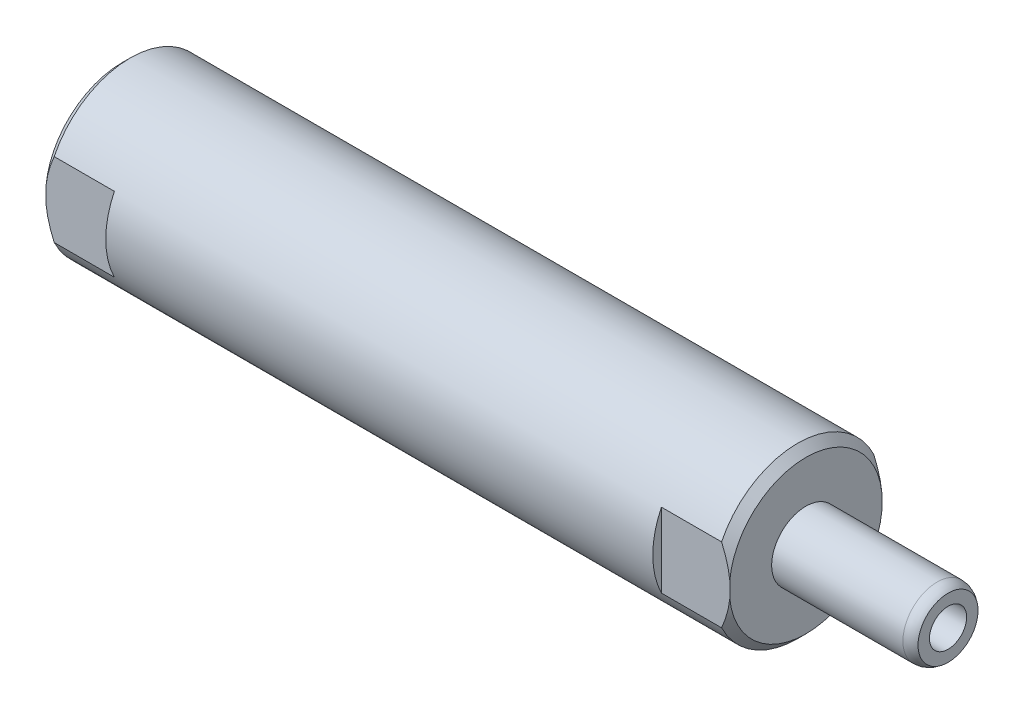
ISO-10303-21;
HEADER;
FILE_DESCRIPTION(('STEP AP214'),'2;1');
FILE_NAME('part.step','',(''),(''),'','','');
FILE_SCHEMA(('AUTOMOTIVE_DESIGN { 1 0 10303 214 1 1 1 1 }'));
ENDSEC;
DATA;
#1=APPLICATION_CONTEXT('core data for automotive mechanical design processes');
#2=APPLICATION_PROTOCOL_DEFINITION('international standard','automotive_design',2000,#1);
#3=PRODUCT_CONTEXT('',#1,'mechanical');
#4=PRODUCT('Part','Part','',(#3));
#5=PRODUCT_RELATED_PRODUCT_CATEGORY('part','',(#4));
#6=PRODUCT_DEFINITION_FORMATION('','',#4);
#7=PRODUCT_DEFINITION_CONTEXT('part definition',#1,'design');
#8=PRODUCT_DEFINITION('design','',#6,#7);
#9=PRODUCT_DEFINITION_SHAPE('','',#8);
#10=(LENGTH_UNIT() NAMED_UNIT(*) SI_UNIT(.MILLI.,.METRE.));
#11=(NAMED_UNIT(*) PLANE_ANGLE_UNIT() SI_UNIT($,.RADIAN.));
#12=(NAMED_UNIT(*) SI_UNIT($,.STERADIAN.) SOLID_ANGLE_UNIT());
#13=UNCERTAINTY_MEASURE_WITH_UNIT(LENGTH_MEASURE(1.E-05),#10,'distance_accuracy_value','');
#14=(GEOMETRIC_REPRESENTATION_CONTEXT(3) GLOBAL_UNCERTAINTY_ASSIGNED_CONTEXT((#13)) GLOBAL_UNIT_ASSIGNED_CONTEXT((#10,
#11,#12)) REPRESENTATION_CONTEXT('',''));
#15=CARTESIAN_POINT('',(0.,0.,0.));
#16=DIRECTION('',(0.,0.,1.));
#17=DIRECTION('',(1.,0.,0.));
#18=AXIS2_PLACEMENT_3D('',#15,#16,#17);
#19=CARTESIAN_POINT('',(62.738,0.,0.));
#20=DIRECTION('',(-1.,0.,0.));
#21=DIRECTION('',(0.,0.,1.));
#22=AXIS2_PLACEMENT_3D('',#19,#20,#21);
#23=CONICAL_SURFACE('',#22,7.8613,0.785398163397451);
#24=CARTESIAN_POINT('',(53.293167338345,-15.800053236075,7.0612));
#25=CARTESIAN_POINT('',(53.5049275174837,-15.5681034147408,7.0612));
#26=CARTESIAN_POINT('',(53.7162690974534,-15.3357714901483,7.0612));
#27=CARTESIAN_POINT('',(54.1379917729007,-14.8702340424233,7.0612));
#28=CARTESIAN_POINT('',(54.3483728600565,-14.6370285117535,7.0612));
#29=CARTESIAN_POINT('',(54.977987894128,-13.935828814462,7.0612));
#30=CARTESIAN_POINT('',(55.3955896179336,-13.4663652133773,7.0612));
#31=CARTESIAN_POINT('',(56.2280256203956,-12.5189680607733,7.0612));
#32=CARTESIAN_POINT('',(56.6428182680432,-12.0409978515424,7.0612));
#33=CARTESIAN_POINT('',(57.4643808191008,-11.0782975911991,7.0612));
#34=CARTESIAN_POINT('',(57.8711517796829,-10.5935684454107,7.0612));
#35=CARTESIAN_POINT('',(58.6122949547526,-9.68939025934885,7.0612));
#36=CARTESIAN_POINT('',(58.948254138589,-9.27124919082648,7.0612));
#37=CARTESIAN_POINT('',(59.4437409714594,-8.63731468734378,7.0612));
#38=CARTESIAN_POINT('',(59.6075217567377,-8.42484595578594,7.0612));
#39=CARTESIAN_POINT('',(59.9316717676401,-7.99732525007659,7.0612));
#40=CARTESIAN_POINT('',(60.0920410862308,-7.78227334657022,7.0612));
#41=CARTESIAN_POINT('',(60.4084499478485,-7.34946591407669,7.0612));
#42=CARTESIAN_POINT('',(60.5644952768056,-7.13171462455565,7.0612));
#43=CARTESIAN_POINT('',(60.8716005394315,-6.69269819678305,7.0612));
#44=CARTESIAN_POINT('',(61.0226602333263,-6.47143289028783,7.0612));
#45=CARTESIAN_POINT('',(61.3185493535055,-6.02492623678023,7.0612));
#46=CARTESIAN_POINT('',(61.4633819995288,-5.79968703158059,7.0612));
#47=CARTESIAN_POINT('',(61.7453735082657,-5.34447391015752,7.0612));
#48=CARTESIAN_POINT('',(61.8825334425164,-5.11450066123727,7.0612));
#49=CARTESIAN_POINT('',(62.1438928545597,-4.65491032616366,7.0612));
#50=CARTESIAN_POINT('',(62.268331805639,-4.42543025459788,7.0612));
#51=CARTESIAN_POINT('',(62.5057045880346,-3.9605167938688,7.0612));
#52=CARTESIAN_POINT('',(62.6186373363574,-3.72508284690978,7.0612));
#53=CARTESIAN_POINT('',(62.8298144638868,-3.24807903864895,7.0612));
#54=CARTESIAN_POINT('',(62.9280808415205,-3.006519015901,7.0612));
#55=CARTESIAN_POINT('',(63.1064608050052,-2.51674849823724,7.0612));
#56=CARTESIAN_POINT('',(63.1865794737875,-2.26853988733677,7.0612));
#57=CARTESIAN_POINT('',(63.311369118663,-1.8142446765933,7.0612));
#58=CARTESIAN_POINT('',(63.3598927316566,-1.60922259694954,7.0612));
#59=CARTESIAN_POINT('',(63.4404053553681,-1.19593626302968,7.0612));
#60=CARTESIAN_POINT('',(63.4723967189886,-0.987672474468585,7.0612));
#61=CARTESIAN_POINT('',(63.5182035163834,-0.569593034806168,7.0612));
#62=CARTESIAN_POINT('',(63.5320589941892,-0.359781834817912,7.0612));
#63=CARTESIAN_POINT('',(63.5409647991822,0.0602465124774527,7.0612));
#64=CARTESIAN_POINT('',(63.5360151148707,0.270463660032706,7.0612));
#65=CARTESIAN_POINT('',(63.5076113556258,0.689272720508541,7.0612));
#66=CARTESIAN_POINT('',(63.4841880322869,0.897866753078743,7.0612));
#67=CARTESIAN_POINT('',(63.4201012842225,1.31236766024443,7.0612));
#68=CARTESIAN_POINT('',(63.3794363985247,1.51827430559842,7.0612));
#69=CARTESIAN_POINT('',(63.2825937366098,1.92696620193596,7.0612));
#70=CARTESIAN_POINT('',(63.226373100563,2.12974117064129,7.0612));
#71=CARTESIAN_POINT('',(63.1006029094311,2.53105472161495,7.0612));
#72=CARTESIAN_POINT('',(63.0310538611671,2.72959346464942,7.0612));
#73=CARTESIAN_POINT('',(62.8568575689925,3.1846553815723,7.0612));
#74=CARTESIAN_POINT('',(62.748075737966,3.43958886594641,7.0612));
#75=CARTESIAN_POINT('',(62.5151562227275,3.94240089487963,7.0612));
#76=CARTESIAN_POINT('',(62.3910103483211,4.19027558921705,7.0612));
#77=CARTESIAN_POINT('',(62.130484648302,4.68010488045319,7.0612));
#78=CARTESIAN_POINT('',(61.994080567097,4.92204647807433,7.0612));
#79=CARTESIAN_POINT('',(61.7118702172748,5.4002882786855,7.0612));
#80=CARTESIAN_POINT('',(61.5660655658289,5.63658944246117,7.0612));
#81=CARTESIAN_POINT('',(61.2653547529032,6.10696672020908,7.0612));
#82=CARTESIAN_POINT('',(61.1103662717776,6.34098996063633,7.0612));
#83=CARTESIAN_POINT('',(60.7942954175425,6.80487911587369,7.0612));
#84=CARTESIAN_POINT('',(60.6332128502206,7.03474489784419,7.0612));
#85=CARTESIAN_POINT('',(60.3063183777181,7.49067027023617,7.0612));
#86=CARTESIAN_POINT('',(60.1405122451545,7.71673401125803,7.0612));
#87=CARTESIAN_POINT('',(59.8048776813793,8.16585887109829,7.0612));
#88=CARTESIAN_POINT('',(59.6350491262695,8.38891989709462,7.0612));
#89=CARTESIAN_POINT('',(59.2177997422505,8.92853278459556,7.0612));
#90=CARTESIAN_POINT('',(58.9686311656389,9.2437321778797,7.0612));
#91=CARTESIAN_POINT('',(58.4650216942898,9.86988942586683,7.0612));
#92=CARTESIAN_POINT('',(58.2105806536195,10.180847162772,7.0612));
#93=CARTESIAN_POINT('',(57.6974048040443,10.7994531726696,7.0612));
#94=CARTESIAN_POINT('',(57.4386679340847,11.1070997330893,7.0612));
#95=CARTESIAN_POINT('',(56.9178424994869,11.7195423881902,7.0612));
#96=CARTESIAN_POINT('',(56.6557539071958,12.0243384593179,7.0612));
#97=CARTESIAN_POINT('',(56.1379939716804,12.6210154756105,7.0612));
#98=CARTESIAN_POINT('',(55.882415812146,12.9129773749483,7.0612));
#99=CARTESIAN_POINT('',(55.3691420373119,13.4950356477495,7.0612));
#100=CARTESIAN_POINT('',(55.1114464091499,13.785132009862,7.0612));
#101=CARTESIAN_POINT('',(54.5945105099742,14.3634805033619,7.0612));
#102=CARTESIAN_POINT('',(54.3352718141855,14.6517340439233,7.0612));
#103=CARTESIAN_POINT('',(53.8152869190554,15.2268678279739,7.0612));
#104=CARTESIAN_POINT('',(53.5545407508161,15.5137480995745,7.0612));
#105=CARTESIAN_POINT('',(53.293167338345,15.800053236075,7.0612));
#106=B_SPLINE_CURVE_WITH_KNOTS('',3,(#24,#25,#26,#27,#28,#29,#30,#31,#32,#33,#34,#35,#36,#37,
#38,#39,#40,#41,#42,#43,#44,#45,#46,#47,#48,#49,#50,#51,#52,#53,#54,#55,#56,#57,#58,#59,#60,#61,
#62,#63,#64,#65,#66,#67,#68,#69,#70,#71,#72,#73,#74,#75,#76,#77,#78,#79,#80,#81,#82,#83,#84,#85,
#86,#87,#88,#89,#90,#91,#92,#93,#94,#95,#96,#97,#98,#99,#100,#101,#102,#103,#104,#105),
.UNSPECIFIED.,.F.,.F.,(4,2,2,2,2,2,2,2,2,2,2,2,2,2,2,2,2,2,2,2,2,2,2,2,2,2,2,2,2,2,2,2,2,2,2,2,
2,2,2,2,4),(0.,0.942223968323323,1.88445608470227,3.76938249821371,5.66789259895274,
7.56615080149852,9.17514997537867,9.97992364540112,10.784675356187,11.5882924133758,
12.3919480627301,13.1951830523521,13.998305584228,14.7811931690603,15.5641543733487,
16.345929131953,17.1274846543602,17.7589523680555,18.3903301852482,19.0203115555243,
19.6502933110106,20.2792285938059,20.9082171803937,21.5389563413221,22.1696715227654,
23.0005071569953,23.8317876126227,24.6647507675351,25.4975710089458,26.339530441258,
27.1815167286011,28.0225147946962,28.8635387988983,30.0688317280415,31.2741580622927,
32.4800804318634,33.6860127571736,34.8500701545965,36.0141346280983,37.1771651926882,
38.3401718468441),.UNSPECIFIED.);
#107=CARTESIAN_POINT('',(62.738,-3.45535703654484,7.0612));
#108=VERTEX_POINT('',#107);
#109=CARTESIAN_POINT('',(63.5,-0.734516882038761,7.0612));
#110=VERTEX_POINT('',#109);
#111=EDGE_CURVE('E42',#108,#110,#106,.T.);
#112=ORIENTED_EDGE('',*,*,#111,.F.);
#113=CARTESIAN_POINT('',(62.738,0.,0.));
#114=DIRECTION('',(1.,0.,0.));
#115=DIRECTION('',(0.,0.,-1.));
#116=AXIS2_PLACEMENT_3D('',#113,#114,#115);
#117=CIRCLE('',#116,7.8613);
#118=CARTESIAN_POINT('',(62.738,-3.45535703654484,-7.0612));
#119=VERTEX_POINT('',#118);
#120=EDGE_CURVE('E142',#119,#108,#117,.F.);
#121=ORIENTED_EDGE('',*,*,#120,.F.);
#122=CARTESIAN_POINT('',(53.293167338345,15.8000532360749,-7.0612));
#123=CARTESIAN_POINT('',(53.5049275174837,15.5681034147408,-7.0612));
#124=CARTESIAN_POINT('',(53.7162690974534,15.3357714901483,-7.0612));
#125=CARTESIAN_POINT('',(54.1379917729007,14.8702340424233,-7.0612));
#126=CARTESIAN_POINT('',(54.3483728600565,14.6370285117535,-7.0612));
#127=CARTESIAN_POINT('',(54.977987894128,13.935828814462,-7.0612));
#128=CARTESIAN_POINT('',(55.3955896179336,13.4663652133773,-7.0612));
#129=CARTESIAN_POINT('',(56.2280256203956,12.5189680607733,-7.0612));
#130=CARTESIAN_POINT('',(56.6428182680432,12.0409978515424,-7.0612));
#131=CARTESIAN_POINT('',(57.4643808191009,11.0782975911991,-7.0612));
#132=CARTESIAN_POINT('',(57.8711517796829,10.5935684454107,-7.0612));
#133=CARTESIAN_POINT('',(58.6122949547526,9.68939025934884,-7.0612));
#134=CARTESIAN_POINT('',(58.948254138589,9.27124919082647,-7.0612));
#135=CARTESIAN_POINT('',(59.4437409714594,8.63731468734376,-7.0612));
#136=CARTESIAN_POINT('',(59.6075217567377,8.42484595578592,-7.0612));
#137=CARTESIAN_POINT('',(59.9316717676401,7.99732525007657,-7.0612));
#138=CARTESIAN_POINT('',(60.0920410862309,7.78227334657019,-7.0612));
#139=CARTESIAN_POINT('',(60.4084499478485,7.34946591407666,-7.0612));
#140=CARTESIAN_POINT('',(60.5644952768057,7.13171462455562,-7.0612));
#141=CARTESIAN_POINT('',(60.8716005394315,6.69269819678301,-7.0612));
#142=CARTESIAN_POINT('',(61.0226602333263,6.47143289028779,-7.0612));
#143=CARTESIAN_POINT('',(61.3185493535056,6.02492623678018,-7.0612));
#144=CARTESIAN_POINT('',(61.4633819995288,5.79968703158054,-7.0612));
#145=CARTESIAN_POINT('',(61.7453735082658,5.34447391015746,-7.0612));
#146=CARTESIAN_POINT('',(61.8825334425165,5.11450066123722,-7.0612));
#147=CARTESIAN_POINT('',(62.1438928545597,4.6549103261636,-7.0612));
#148=CARTESIAN_POINT('',(62.2683318056391,4.42543025459783,-7.0612));
#149=CARTESIAN_POINT('',(62.5057045880346,3.96051679386875,-7.0612));
#150=CARTESIAN_POINT('',(62.6186373363574,3.72508284690973,-7.0612));
#151=CARTESIAN_POINT('',(62.8298144638868,3.2480790386489,-7.0612));
#152=CARTESIAN_POINT('',(62.9280808415205,3.00651901590095,-7.0612));
#153=CARTESIAN_POINT('',(63.1064608050052,2.51674849823718,-7.0612));
#154=CARTESIAN_POINT('',(63.1865794737875,2.26853988733672,-7.0612));
#155=CARTESIAN_POINT('',(63.311369118663,1.81424467659325,-7.0612));
#156=CARTESIAN_POINT('',(63.3598927316566,1.60922259694949,-7.0612));
#157=CARTESIAN_POINT('',(63.4404053553682,1.19593626302963,-7.0612));
#158=CARTESIAN_POINT('',(63.4723967189886,0.987672474468532,-7.0612));
#159=CARTESIAN_POINT('',(63.5182035163834,0.569593034806117,-7.0612));
#160=CARTESIAN_POINT('',(63.5320589941892,0.359781834817861,-7.0612));
#161=CARTESIAN_POINT('',(63.5409647991822,-0.0602465124775034,-7.0612));
#162=CARTESIAN_POINT('',(63.5360151148707,-0.270463660032755,-7.0612));
#163=CARTESIAN_POINT('',(63.5076113556258,-0.689272720508589,-7.0612));
#164=CARTESIAN_POINT('',(63.4841880322869,-0.897866753078792,-7.0612));
#165=CARTESIAN_POINT('',(63.4201012842224,-1.31236766024448,-7.0612));
#166=CARTESIAN_POINT('',(63.3794363985247,-1.51827430559847,-7.0612));
#167=CARTESIAN_POINT('',(63.2825937366098,-1.92696620193601,-7.0612));
#168=CARTESIAN_POINT('',(63.226373100563,-2.12974117064134,-7.0612));
#169=CARTESIAN_POINT('',(63.1006029094311,-2.53105472161499,-7.0612));
#170=CARTESIAN_POINT('',(63.031053861167,-2.72959346464946,-7.0612));
#171=CARTESIAN_POINT('',(62.8568575689925,-3.18465538157235,-7.0612));
#172=CARTESIAN_POINT('',(62.748075737966,-3.43958886594646,-7.0612));
#173=CARTESIAN_POINT('',(62.5151562227275,-3.94240089487968,-7.0612));
#174=CARTESIAN_POINT('',(62.3910103483211,-4.19027558921711,-7.0612));
#175=CARTESIAN_POINT('',(62.130484648302,-4.68010488045326,-7.0612));
#176=CARTESIAN_POINT('',(61.994080567097,-4.92204647807441,-7.0612));
#177=CARTESIAN_POINT('',(61.7118702172748,-5.40028827868558,-7.0612));
#178=CARTESIAN_POINT('',(61.5660655658289,-5.63658944246126,-7.0612));
#179=CARTESIAN_POINT('',(61.2653547529031,-6.10696672020917,-7.0612));
#180=CARTESIAN_POINT('',(61.1103662717776,-6.34098996063642,-7.0612));
#181=CARTESIAN_POINT('',(60.7942954175424,-6.80487911587379,-7.0612));
#182=CARTESIAN_POINT('',(60.6332128502205,-7.03474489784429,-7.0612));
#183=CARTESIAN_POINT('',(60.306318377718,-7.49067027023629,-7.0612));
#184=CARTESIAN_POINT('',(60.1405122451544,-7.71673401125815,-7.0612));
#185=CARTESIAN_POINT('',(59.8048776813792,-8.16585887109841,-7.0612));
#186=CARTESIAN_POINT('',(59.6350491262694,-8.38891989709475,-7.0612));
#187=CARTESIAN_POINT('',(59.2177997422503,-8.92853278459569,-7.0612));
#188=CARTESIAN_POINT('',(58.9686311656388,-9.24373217787982,-7.0612));
#189=CARTESIAN_POINT('',(58.4650216942897,-9.86988942586693,-7.0612));
#190=CARTESIAN_POINT('',(58.2105806536194,-10.1808471627721,-7.0612));
#191=CARTESIAN_POINT('',(57.6974048040443,-10.7994531726697,-7.0612));
#192=CARTESIAN_POINT('',(57.4386679340846,-11.1070997330893,-7.0612));
#193=CARTESIAN_POINT('',(56.9178424994869,-11.7195423881902,-7.0612));
#194=CARTESIAN_POINT('',(56.6557539071957,-12.0243384593179,-7.0612));
#195=CARTESIAN_POINT('',(56.1379939716803,-12.6210154756105,-7.0612));
#196=CARTESIAN_POINT('',(55.882415812146,-12.9129773749484,-7.0612));
#197=CARTESIAN_POINT('',(55.3691420373118,-13.4950356477496,-7.0612));
#198=CARTESIAN_POINT('',(55.1114464091499,-13.785132009862,-7.0612));
#199=CARTESIAN_POINT('',(54.5945105099742,-14.3634805033619,-7.0612));
#200=CARTESIAN_POINT('',(54.3352718141854,-14.6517340439233,-7.0612));
#201=CARTESIAN_POINT('',(53.8152869190554,-15.2268678279739,-7.0612));
#202=CARTESIAN_POINT('',(53.5545407508161,-15.5137480995745,-7.0612));
#203=CARTESIAN_POINT('',(53.293167338345,-15.8000532360749,-7.0612));
#204=B_SPLINE_CURVE_WITH_KNOTS('',3,(#122,#123,#124,#125,#126,#127,#128,#129,#130,#131,#132,
#133,#134,#135,#136,#137,#138,#139,#140,#141,#142,#143,#144,#145,#146,#147,#148,#149,#150,#151,
#152,#153,#154,#155,#156,#157,#158,#159,#160,#161,#162,#163,#164,#165,#166,#167,#168,#169,#170,
#171,#172,#173,#174,#175,#176,#177,#178,#179,#180,#181,#182,#183,#184,#185,#186,#187,#188,#189,
#190,#191,#192,#193,#194,#195,#196,#197,#198,#199,#200,#201,#202,#203),.UNSPECIFIED.,.F.,.F.,(4,
2,2,2,2,2,2,2,2,2,2,2,2,2,2,2,2,2,2,2,2,2,2,2,2,2,2,2,2,2,2,2,2,2,2,2,2,2,2,2,4),(0.,
0.942223968323325,1.88445608470226,3.76938249821372,5.66789259895274,7.56615080149853,
9.17514997537869,9.97992364540114,10.7846753561871,11.5882924133758,12.3919480627302,
13.1951830523521,13.9983055842281,14.7811931690603,15.5641543733487,16.3459291319531,
17.1274846543603,17.7589523680556,18.3903301852483,19.0203115555244,19.6502933110106,
20.279228593806,20.9082171803937,21.5389563413221,22.1696715227655,23.0005071569953,
23.8317876126228,24.6647507675352,25.4975710089459,26.3395304412581,27.1815167286012,
28.0225147946964,28.8635387988985,30.0688317280417,31.2741580622928,32.4800804318635,
33.6860127571737,34.8500701545966,36.0141346280983,37.1771651926882,38.3401718468441),.UNSPECIFIED.);
#205=CARTESIAN_POINT('',(63.5,-0.734516882038759,-7.0612));
#206=VERTEX_POINT('',#205);
#207=EDGE_CURVE('E312',#206,#119,#204,.T.);
#208=ORIENTED_EDGE('',*,*,#207,.F.);
#209=CARTESIAN_POINT('',(63.5,0.,0.));
#210=DIRECTION('',(1.,0.,0.));
#211=DIRECTION('',(0.,0.,-1.));
#212=AXIS2_PLACEMENT_3D('',#209,#210,#211);
#213=CIRCLE('',#212,7.0993);
#214=EDGE_CURVE('E56',#110,#206,#213,.T.);
#215=ORIENTED_EDGE('',*,*,#214,.F.);
#216=EDGE_LOOP('',(#112,#121,#208,#215));
#217=FACE_BOUND('',#216,.T.);
#218=ADVANCED_FACE('F33',(#217),#23,.T.);
#219=CARTESIAN_POINT('',(0.,0.,0.));
#220=DIRECTION('',(1.,0.,0.));
#221=DIRECTION('',(0.,0.,-1.));
#222=AXIS2_PLACEMENT_3D('',#219,#220,#221);
#223=CONICAL_SURFACE('',#222,7.0993,0.785398163397437);
#224=CARTESIAN_POINT('',(10.206832661655,15.8000532360747,7.0612));
#225=CARTESIAN_POINT('',(9.99507248251633,15.5681034147405,7.0612));
#226=CARTESIAN_POINT('',(9.78373090254667,15.3357714901481,7.0612));
#227=CARTESIAN_POINT('',(9.36200822709937,14.870234042423,7.0612));
#228=CARTESIAN_POINT('',(9.15162713994351,14.6370285117533,7.0612));
#229=CARTESIAN_POINT('',(8.52201210587203,13.9358288144618,7.0612));
#230=CARTESIAN_POINT('',(8.10441038206648,13.4663652133772,7.0612));
#231=CARTESIAN_POINT('',(7.27197437960443,12.5189680607732,7.0612));
#232=CARTESIAN_POINT('',(6.85718173195692,12.0409978515423,7.0612));
#233=CARTESIAN_POINT('',(6.03561918089923,11.078297591199,7.0612));
#234=CARTESIAN_POINT('',(5.62884822031721,10.5935684454106,7.0612));
#235=CARTESIAN_POINT('',(4.88770504524749,9.68939025934882,7.0612));
#236=CARTESIAN_POINT('',(4.55174586141112,9.27124919082648,7.0612));
#237=CARTESIAN_POINT('',(4.05625902854075,8.63731468734381,7.0612));
#238=CARTESIAN_POINT('',(3.8924782432624,8.42484595578598,7.0612));
#239=CARTESIAN_POINT('',(3.56832823236001,7.99732525007667,7.0612));
#240=CARTESIAN_POINT('',(3.40795891376932,7.78227334657031,7.0612));
#241=CARTESIAN_POINT('',(3.09155005215165,7.3494659140768,7.0612));
#242=CARTESIAN_POINT('',(2.93550472319452,7.13171462455578,7.0612));
#243=CARTESIAN_POINT('',(2.62839946056867,6.6926981967832,7.0612));
#244=CARTESIAN_POINT('',(2.47733976667385,6.471432890288,7.0612));
#245=CARTESIAN_POINT('',(2.18145064649465,6.02492623678043,7.0612));
#246=CARTESIAN_POINT('',(2.03661800047142,5.7996870315808,7.0612));
#247=CARTESIAN_POINT('',(1.75462649173447,5.34447391015776,7.0612));
#248=CARTESIAN_POINT('',(1.61746655748374,5.11450066123754,7.0612));
#249=CARTESIAN_POINT('',(1.35610714544049,4.65491032616393,7.0612));
#250=CARTESIAN_POINT('',(1.23166819436114,4.42543025459815,7.0612));
#251=CARTESIAN_POINT('',(0.994295411965531,3.96051679386908,7.0612));
#252=CARTESIAN_POINT('',(0.881362663642727,3.72508284691006,7.0612));
#253=CARTESIAN_POINT('',(0.670185536113354,3.24807903864922,7.0612));
#254=CARTESIAN_POINT('',(0.571919158479581,3.00651901590127,7.0612));
#255=CARTESIAN_POINT('',(0.39353919499491,2.5167484982375,7.0612));
#256=CARTESIAN_POINT('',(0.313420526212575,2.26853988733704,7.0612));
#257=CARTESIAN_POINT('',(0.18863088133711,1.81424467659357,7.0612));
#258=CARTESIAN_POINT('',(0.140107268343498,1.60922259694981,7.0612));
#259=CARTESIAN_POINT('',(0.0595946446318899,1.19593626302996,7.0612));
#260=CARTESIAN_POINT('',(0.0276032810114563,0.98767247446887,7.0612));
#261=CARTESIAN_POINT('',(-0.0182035163833669,0.569593034806462,7.0612));
#262=CARTESIAN_POINT('',(-0.0320589941891739,0.35978183481821,7.0612));
#263=CARTESIAN_POINT('',(-0.0409647991821803,-0.0602465124771493,7.0612));
#264=CARTESIAN_POINT('',(-0.0360151148707246,-0.270463660032399,7.0612));
#265=CARTESIAN_POINT('',(-0.00761135562582039,-0.689272720508228,7.0612));
#266=CARTESIAN_POINT('',(0.0158119677130364,-0.897866753078429,7.0612));
#267=CARTESIAN_POINT('',(0.079898715777477,-1.31236766024411,7.0612));
#268=CARTESIAN_POINT('',(0.120563601475266,-1.5182743055981,7.0612));
#269=CARTESIAN_POINT('',(0.217406263390111,-1.92696620193564,7.0612));
#270=CARTESIAN_POINT('',(0.273626899436888,-2.12974117064097,7.0612));
#271=CARTESIAN_POINT('',(0.399397090568765,-2.53105472161463,7.0612));
#272=CARTESIAN_POINT('',(0.468946138832838,-2.7295934646491,7.0612));
#273=CARTESIAN_POINT('',(0.643142431007394,-3.18465538157195,7.0612));
#274=CARTESIAN_POINT('',(0.751924262033857,-3.43958886594601,7.0612));
#275=CARTESIAN_POINT('',(0.984843777272306,-3.94240089487915,7.0612));
#276=CARTESIAN_POINT('',(1.10898965167868,-4.19027558921654,7.0612));
#277=CARTESIAN_POINT('',(1.3695153516977,-4.68010488045261,7.0612));
#278=CARTESIAN_POINT('',(1.50591943290268,-4.92204647807372,7.0612));
#279=CARTESIAN_POINT('',(1.78812978272483,-5.40028827868481,7.0612));
#280=CARTESIAN_POINT('',(1.93393443417064,-5.63658944246045,7.0612));
#281=CARTESIAN_POINT('',(2.23464524709636,-6.10696672020829,7.0612));
#282=CARTESIAN_POINT('',(2.38963372822189,-6.3409899606355,7.0612));
#283=CARTESIAN_POINT('',(2.70570458245695,-6.80487911587279,7.0612));
#284=CARTESIAN_POINT('',(2.86678714977881,-7.03474489784326,7.0612));
#285=CARTESIAN_POINT('',(3.19368162228128,-7.49067027023518,7.0612));
#286=CARTESIAN_POINT('',(3.35948775484481,-7.716734011257,7.0612));
#287=CARTESIAN_POINT('',(3.69512231861993,-8.1658588710972,7.0612));
#288=CARTESIAN_POINT('',(3.86495087372976,-8.38891989709349,7.0612));
#289=CARTESIAN_POINT('',(4.28220025774878,-8.92853278459445,7.0612));
#290=CARTESIAN_POINT('',(4.53136883436035,-9.24373217787863,7.0612));
#291=CARTESIAN_POINT('',(5.03497830570952,-9.86988942586584,7.0612));
#292=CARTESIAN_POINT('',(5.28941934637984,-10.180847162771,7.0612));
#293=CARTESIAN_POINT('',(5.80259519595511,-10.7994531726688,7.0612));
#294=CARTESIAN_POINT('',(6.06133206591477,-11.1070997330884,7.0612));
#295=CARTESIAN_POINT('',(6.58215750051263,-11.7195423881894,7.0612));
#296=CARTESIAN_POINT('',(6.84424609280381,-12.0243384593172,7.0612));
#297=CARTESIAN_POINT('',(7.3620060283193,-12.6210154756098,7.0612));
#298=CARTESIAN_POINT('',(7.61758418785368,-12.9129773749477,7.0612));
#299=CARTESIAN_POINT('',(8.13085796268788,-13.495035647749,7.0612));
#300=CARTESIAN_POINT('',(8.38855359084985,-13.7851320098615,7.0612));
#301=CARTESIAN_POINT('',(8.90548949002565,-14.3634805033614,7.0612));
#302=CARTESIAN_POINT('',(9.16472818581444,-14.6517340439229,7.0612));
#303=CARTESIAN_POINT('',(9.68471308094451,-15.2268678279736,7.0612));
#304=CARTESIAN_POINT('',(9.94545924918386,-15.5137480995742,7.0612));
#305=CARTESIAN_POINT('',(10.206832661655,-15.8000532360747,7.0612));
#306=B_SPLINE_CURVE_WITH_KNOTS('',3,(#224,#225,#226,#227,#228,#229,#230,#231,#232,#233,#234,
#235,#236,#237,#238,#239,#240,#241,#242,#243,#244,#245,#246,#247,#248,#249,#250,#251,#252,#253,
#254,#255,#256,#257,#258,#259,#260,#261,#262,#263,#264,#265,#266,#267,#268,#269,#270,#271,#272,
#273,#274,#275,#276,#277,#278,#279,#280,#281,#282,#283,#284,#285,#286,#287,#288,#289,#290,#291,
#292,#293,#294,#295,#296,#297,#298,#299,#300,#301,#302,#303,#304,#305),.UNSPECIFIED.,.F.,.F.,(4,
2,2,2,2,2,2,2,2,2,2,2,2,2,2,2,2,2,2,2,2,2,2,2,2,2,2,2,2,2,2,2,2,2,2,2,2,2,2,2,4),(0.,
0.942223968323294,1.88445608470221,3.76938249821361,5.66789259895258,7.56615080149831,
9.17514997537837,9.97992364540078,10.7846753561867,11.5882924133753,12.3919480627297,
13.1951830523516,13.9983055842274,14.7811931690597,15.5641543733481,16.3459291319525,
17.1274846543597,17.758952368055,18.3903301852477,19.0203115555238,19.65029331101,
20.2792285938054,20.9082171803932,21.5389563413216,22.1696715227649,23.0005071569946,
23.8317876126219,24.6647507675341,25.4975710089447,26.3395304412567,27.1815167285997,
28.0225147946947,28.8635387988967,30.06883172804,31.2741580622914,32.4800804318623,
33.6860127571726,34.8500701545957,36.0141346280976,37.1771651926877,38.3401718468437),.UNSPECIFIED.);
#307=CARTESIAN_POINT('',(0.762000000000012,3.45535703654484,7.0612));
#308=VERTEX_POINT('',#307);
#309=CARTESIAN_POINT('',(0.,0.734516882038824,7.0612));
#310=VERTEX_POINT('',#309);
#311=EDGE_CURVE('E316',#308,#310,#306,.T.);
#312=ORIENTED_EDGE('',*,*,#311,.F.);
#313=CARTESIAN_POINT('',(0.762000000000013,0.,0.));
#314=DIRECTION('',(-1.,0.,0.));
#315=DIRECTION('',(0.,0.,1.));
#316=AXIS2_PLACEMENT_3D('',#313,#314,#315);
#317=CIRCLE('',#316,7.8613);
#318=CARTESIAN_POINT('',(0.762000000000012,3.45535703654484,-7.0612));
#319=VERTEX_POINT('',#318);
#320=EDGE_CURVE('E215',#319,#308,#317,.F.);
#321=ORIENTED_EDGE('',*,*,#320,.F.);
#322=CARTESIAN_POINT('',(10.206832661655,-15.8000532360747,-7.0612));
#323=CARTESIAN_POINT('',(9.99507248251633,-15.5681034147405,-7.0612));
#324=CARTESIAN_POINT('',(9.78373090254667,-15.3357714901481,-7.0612));
#325=CARTESIAN_POINT('',(9.36200822709937,-14.870234042423,-7.0612));
#326=CARTESIAN_POINT('',(9.15162713994351,-14.6370285117533,-7.0612));
#327=CARTESIAN_POINT('',(8.52201210587203,-13.9358288144618,-7.0612));
#328=CARTESIAN_POINT('',(8.10441038206648,-13.4663652133772,-7.0612));
#329=CARTESIAN_POINT('',(7.27197437960443,-12.5189680607732,-7.0612));
#330=CARTESIAN_POINT('',(6.85718173195692,-12.0409978515423,-7.0612));
#331=CARTESIAN_POINT('',(6.03561918089923,-11.078297591199,-7.0612));
#332=CARTESIAN_POINT('',(5.62884822031721,-10.5935684454106,-7.0612));
#333=CARTESIAN_POINT('',(4.88770504524749,-9.68939025934882,-7.0612));
#334=CARTESIAN_POINT('',(4.55174586141112,-9.27124919082648,-7.0612));
#335=CARTESIAN_POINT('',(4.05625902854075,-8.63731468734381,-7.0612));
#336=CARTESIAN_POINT('',(3.8924782432624,-8.42484595578598,-7.0612));
#337=CARTESIAN_POINT('',(3.56832823236001,-7.99732525007667,-7.0612));
#338=CARTESIAN_POINT('',(3.40795891376932,-7.78227334657031,-7.0612));
#339=CARTESIAN_POINT('',(3.09155005215165,-7.3494659140768,-7.0612));
#340=CARTESIAN_POINT('',(2.93550472319452,-7.13171462455578,-7.0612));
#341=CARTESIAN_POINT('',(2.62839946056867,-6.6926981967832,-7.0612));
#342=CARTESIAN_POINT('',(2.47733976667385,-6.471432890288,-7.0612));
#343=CARTESIAN_POINT('',(2.18145064649465,-6.02492623678043,-7.0612));
#344=CARTESIAN_POINT('',(2.03661800047142,-5.7996870315808,-7.0612));
#345=CARTESIAN_POINT('',(1.75462649173447,-5.34447391015776,-7.0612));
#346=CARTESIAN_POINT('',(1.61746655748374,-5.11450066123754,-7.0612));
#347=CARTESIAN_POINT('',(1.35610714544049,-4.65491032616393,-7.0612));
#348=CARTESIAN_POINT('',(1.23166819436114,-4.42543025459815,-7.0612));
#349=CARTESIAN_POINT('',(0.994295411965531,-3.96051679386908,-7.0612));
#350=CARTESIAN_POINT('',(0.881362663642727,-3.72508284691006,-7.0612));
#351=CARTESIAN_POINT('',(0.670185536113354,-3.24807903864922,-7.0612));
#352=CARTESIAN_POINT('',(0.571919158479581,-3.00651901590127,-7.0612));
#353=CARTESIAN_POINT('',(0.39353919499491,-2.5167484982375,-7.0612));
#354=CARTESIAN_POINT('',(0.313420526212575,-2.26853988733704,-7.0612));
#355=CARTESIAN_POINT('',(0.18863088133711,-1.81424467659357,-7.0612));
#356=CARTESIAN_POINT('',(0.140107268343498,-1.60922259694981,-7.0612));
#357=CARTESIAN_POINT('',(0.0595946446318899,-1.19593626302996,-7.0612));
#358=CARTESIAN_POINT('',(0.0276032810114563,-0.98767247446887,-7.0612));
#359=CARTESIAN_POINT('',(-0.0182035163833669,-0.569593034806462,-7.0612));
#360=CARTESIAN_POINT('',(-0.0320589941891739,-0.35978183481821,-7.0612));
#361=CARTESIAN_POINT('',(-0.0409647991821803,0.0602465124771493,-7.0612));
#362=CARTESIAN_POINT('',(-0.0360151148707246,0.270463660032399,-7.0612));
#363=CARTESIAN_POINT('',(-0.00761135562582039,0.689272720508228,-7.0612));
#364=CARTESIAN_POINT('',(0.0158119677130364,0.897866753078429,-7.0612));
#365=CARTESIAN_POINT('',(0.079898715777477,1.31236766024411,-7.0612));
#366=CARTESIAN_POINT('',(0.120563601475266,1.5182743055981,-7.0612));
#367=CARTESIAN_POINT('',(0.217406263390111,1.92696620193564,-7.0612));
#368=CARTESIAN_POINT('',(0.273626899436888,2.12974117064097,-7.0612));
#369=CARTESIAN_POINT('',(0.399397090568765,2.53105472161463,-7.0612));
#370=CARTESIAN_POINT('',(0.468946138832838,2.7295934646491,-7.0612));
#371=CARTESIAN_POINT('',(0.643142431007394,3.18465538157195,-7.0612));
#372=CARTESIAN_POINT('',(0.751924262033857,3.43958886594601,-7.0612));
#373=CARTESIAN_POINT('',(0.984843777272306,3.94240089487915,-7.0612));
#374=CARTESIAN_POINT('',(1.10898965167868,4.19027558921654,-7.0612));
#375=CARTESIAN_POINT('',(1.3695153516977,4.68010488045261,-7.0612));
#376=CARTESIAN_POINT('',(1.50591943290268,4.92204647807372,-7.0612));
#377=CARTESIAN_POINT('',(1.78812978272483,5.40028827868481,-7.0612));
#378=CARTESIAN_POINT('',(1.93393443417064,5.63658944246045,-7.0612));
#379=CARTESIAN_POINT('',(2.23464524709636,6.10696672020829,-7.0612));
#380=CARTESIAN_POINT('',(2.38963372822189,6.3409899606355,-7.0612));
#381=CARTESIAN_POINT('',(2.70570458245695,6.80487911587279,-7.0612));
#382=CARTESIAN_POINT('',(2.86678714977881,7.03474489784326,-7.0612));
#383=CARTESIAN_POINT('',(3.19368162228128,7.49067027023518,-7.0612));
#384=CARTESIAN_POINT('',(3.35948775484481,7.716734011257,-7.0612));
#385=CARTESIAN_POINT('',(3.69512231861993,8.1658588710972,-7.0612));
#386=CARTESIAN_POINT('',(3.86495087372976,8.38891989709349,-7.0612));
#387=CARTESIAN_POINT('',(4.28220025774878,8.92853278459445,-7.0612));
#388=CARTESIAN_POINT('',(4.53136883436035,9.24373217787863,-7.0612));
#389=CARTESIAN_POINT('',(5.03497830570952,9.86988942586584,-7.0612));
#390=CARTESIAN_POINT('',(5.28941934637984,10.180847162771,-7.0612));
#391=CARTESIAN_POINT('',(5.80259519595511,10.7994531726688,-7.0612));
#392=CARTESIAN_POINT('',(6.06133206591477,11.1070997330884,-7.0612));
#393=CARTESIAN_POINT('',(6.58215750051263,11.7195423881894,-7.0612));
#394=CARTESIAN_POINT('',(6.84424609280381,12.0243384593172,-7.0612));
#395=CARTESIAN_POINT('',(7.3620060283193,12.6210154756098,-7.0612));
#396=CARTESIAN_POINT('',(7.61758418785368,12.9129773749477,-7.0612));
#397=CARTESIAN_POINT('',(8.13085796268788,13.495035647749,-7.0612));
#398=CARTESIAN_POINT('',(8.38855359084985,13.7851320098615,-7.0612));
#399=CARTESIAN_POINT('',(8.90548949002565,14.3634805033614,-7.0612));
#400=CARTESIAN_POINT('',(9.16472818581444,14.6517340439229,-7.0612));
#401=CARTESIAN_POINT('',(9.68471308094451,15.2268678279736,-7.0612));
#402=CARTESIAN_POINT('',(9.94545924918386,15.5137480995742,-7.0612));
#403=CARTESIAN_POINT('',(10.206832661655,15.8000532360747,-7.0612));
#404=B_SPLINE_CURVE_WITH_KNOTS('',3,(#322,#323,#324,#325,#326,#327,#328,#329,#330,#331,#332,
#333,#334,#335,#336,#337,#338,#339,#340,#341,#342,#343,#344,#345,#346,#347,#348,#349,#350,#351,
#352,#353,#354,#355,#356,#357,#358,#359,#360,#361,#362,#363,#364,#365,#366,#367,#368,#369,#370,
#371,#372,#373,#374,#375,#376,#377,#378,#379,#380,#381,#382,#383,#384,#385,#386,#387,#388,#389,
#390,#391,#392,#393,#394,#395,#396,#397,#398,#399,#400,#401,#402,#403),.UNSPECIFIED.,.F.,.F.,(4,
2,2,2,2,2,2,2,2,2,2,2,2,2,2,2,2,2,2,2,2,2,2,2,2,2,2,2,2,2,2,2,2,2,2,2,2,2,2,2,4),(0.,
0.942223968323294,1.88445608470221,3.76938249821361,5.66789259895258,7.56615080149831,
9.17514997537837,9.97992364540078,10.7846753561867,11.5882924133753,12.3919480627297,
13.1951830523516,13.9983055842274,14.7811931690597,15.5641543733481,16.3459291319525,
17.1274846543597,17.758952368055,18.3903301852477,19.0203115555238,19.65029331101,
20.2792285938054,20.9082171803932,21.5389563413216,22.1696715227649,23.0005071569946,
23.8317876126219,24.6647507675341,25.4975710089447,26.3395304412567,27.1815167285997,
28.0225147946947,28.8635387988967,30.06883172804,31.2741580622914,32.4800804318623,
33.6860127571726,34.8500701545957,36.0141346280976,37.1771651926877,38.3401718468437),.UNSPECIFIED.);
#405=CARTESIAN_POINT('',(0.,0.734516882038823,-7.0612));
#406=VERTEX_POINT('',#405);
#407=EDGE_CURVE('E221',#406,#319,#404,.T.);
#408=ORIENTED_EDGE('',*,*,#407,.F.);
#409=CARTESIAN_POINT('',(0.,0.,0.));
#410=DIRECTION('',(-1.,0.,0.));
#411=DIRECTION('',(0.,0.,1.));
#412=AXIS2_PLACEMENT_3D('',#409,#410,#411);
#413=CIRCLE('',#412,7.0993);
#414=EDGE_CURVE('E208',#310,#406,#413,.T.);
#415=ORIENTED_EDGE('',*,*,#414,.F.);
#416=EDGE_LOOP('',(#312,#321,#408,#415));
#417=FACE_BOUND('',#416,.T.);
#418=ADVANCED_FACE('F284',(#417),#223,.T.);
#419=CARTESIAN_POINT('',(75.692,0.,0.));
#420=DIRECTION('',(-1.,0.,0.));
#421=DIRECTION('',(0.,0.,1.));
#422=AXIS2_PLACEMENT_3D('',#419,#420,#421);
#423=TOROIDAL_SURFACE('',#422,1.651,1.524);
#424=CARTESIAN_POINT('',(76.708,0.,0.));
#425=DIRECTION('',(-1.,0.,0.));
#426=DIRECTION('',(0.,0.,1.));
#427=AXIS2_PLACEMENT_3D('',#424,#425,#426);
#428=CIRCLE('',#427,2.7869225325699);
#429=CARTESIAN_POINT('',(76.708,0.,2.7869225325699));
#430=VERTEX_POINT('',#429);
#431=EDGE_CURVE('E205',#430,#430,#428,.T.);
#432=ORIENTED_EDGE('',*,*,#431,.T.);
#433=EDGE_LOOP('',(#432));
#434=FACE_BOUND('',#433,.T.);
#435=CARTESIAN_POINT('',(75.692,0.,0.));
#436=DIRECTION('',(-1.,0.,0.));
#437=DIRECTION('',(0.,0.,1.));
#438=AXIS2_PLACEMENT_3D('',#435,#436,#437);
#439=CIRCLE('',#438,3.175);
#440=CARTESIAN_POINT('',(75.692,0.,3.175));
#441=VERTEX_POINT('',#440);
#442=EDGE_CURVE('E199',#441,#441,#439,.T.);
#443=ORIENTED_EDGE('',*,*,#442,.F.);
#444=EDGE_LOOP('',(#443));
#445=FACE_BOUND('',#444,.T.);
#446=ADVANCED_FACE('F281',(#434,#445),#423,.T.);
#447=CARTESIAN_POINT('',(76.708,2.7869225325699,0.));
#448=DIRECTION('',(1.,0.,0.));
#449=DIRECTION('',(0.,0.,-1.));
#450=AXIS2_PLACEMENT_3D('',#447,#448,#449);
#451=PLANE('',#450);
#452=CARTESIAN_POINT('',(76.708,0.,0.));
#453=DIRECTION('',(-1.,0.,0.));
#454=DIRECTION('',(0.,0.,1.));
#455=AXIS2_PLACEMENT_3D('',#452,#453,#454);
#456=CIRCLE('',#455,1.7272);
#457=CARTESIAN_POINT('',(76.708,0.,1.7272));
#458=VERTEX_POINT('',#457);
#459=EDGE_CURVE('E184',#458,#458,#456,.T.);
#460=ORIENTED_EDGE('',*,*,#459,.T.);
#461=EDGE_LOOP('',(#460));
#462=FACE_BOUND('',#461,.T.);
#463=ORIENTED_EDGE('',*,*,#431,.F.);
#464=EDGE_LOOP('',(#463));
#465=FACE_BOUND('',#464,.T.);
#466=ADVANCED_FACE('F278',(#462,#465),#451,.T.);
#467=CARTESIAN_POINT('',(0.,0.,0.));
#468=DIRECTION('',(-1.,0.,0.));
#469=DIRECTION('',(0.,0.,1.));
#470=AXIS2_PLACEMENT_3D('',#467,#468,#469);
#471=PLANE('',#470);
#472=DIRECTION('',(0.,1.,0.));
#473=VECTOR('',#472,1.);
#474=CARTESIAN_POINT('',(0.,-7.8613,7.0612));
#475=LINE('',#474,#473);
#476=CARTESIAN_POINT('',(0.,-0.734516882038823,7.0612));
#477=VERTEX_POINT('',#476);
#478=EDGE_CURVE('E159',#477,#310,#475,.T.);
#479=ORIENTED_EDGE('',*,*,#478,.T.);
#480=ORIENTED_EDGE('',*,*,#414,.T.);
#481=DIRECTION('',(0.,1.,0.));
#482=VECTOR('',#481,1.);
#483=CARTESIAN_POINT('',(0.,-7.8613,-7.0612));
#484=LINE('',#483,#482);
#485=CARTESIAN_POINT('',(0.,-0.734516882038824,-7.0612));
#486=VERTEX_POINT('',#485);
#487=EDGE_CURVE('E169',#486,#406,#484,.T.);
#488=ORIENTED_EDGE('',*,*,#487,.F.);
#489=EDGE_CURVE('E209',#486,#477,#413,.T.);
#490=ORIENTED_EDGE('',*,*,#489,.T.);
#491=EDGE_LOOP('',(#479,#480,#488,#490));
#492=FACE_BOUND('',#491,.T.);
#493=CARTESIAN_POINT('',(-1.21534726726935E-11,0.,0.));
#494=DIRECTION('',(-1.,0.,0.));
#495=DIRECTION('',(0.,0.,1.));
#496=AXIS2_PLACEMENT_3D('',#493,#494,#495);
#497=CIRCLE('',#496,6.18489999999376);
#498=CARTESIAN_POINT('',(-1.21534726726935E-11,0.,6.18489999999376));
#499=VERTEX_POINT('',#498);
#500=EDGE_CURVE('E190',#499,#499,#497,.T.);
#501=ORIENTED_EDGE('',*,*,#500,.F.);
#502=EDGE_LOOP('',(#501));
#503=FACE_BOUND('',#502,.T.);
#504=ADVANCED_FACE('F275',(#492,#503),#471,.T.);
#505=CARTESIAN_POINT('',(76.708,0.,0.));
#506=DIRECTION('',(-1.,0.,0.));
#507=DIRECTION('',(0.,0.,1.));
#508=AXIS2_PLACEMENT_3D('',#505,#506,#507);
#509=CYLINDRICAL_SURFACE('',#508,7.8613);
#510=DIRECTION('',(-1.,0.,0.));
#511=VECTOR('',#510,1.);
#512=CARTESIAN_POINT('',(76.708,-3.45535703654484,7.0612));
#513=LINE('',#512,#511);
#514=CARTESIAN_POINT('',(57.15,-3.45535703654484,7.0612));
#515=VERTEX_POINT('',#514);
#516=EDGE_CURVE('E133',#515,#108,#513,.F.);
#517=ORIENTED_EDGE('',*,*,#516,.F.);
#518=CARTESIAN_POINT('',(57.15,0.,0.));
#519=DIRECTION('',(-1.,0.,0.));
#520=DIRECTION('',(0.,0.,1.));
#521=AXIS2_PLACEMENT_3D('',#518,#519,#520);
#522=CIRCLE('',#521,7.8613);
#523=CARTESIAN_POINT('',(57.15,3.45535703654484,7.0612));
#524=VERTEX_POINT('',#523);
#525=EDGE_CURVE('E11',#524,#515,#522,.F.);
#526=ORIENTED_EDGE('',*,*,#525,.F.);
#527=DIRECTION('',(-1.,0.,0.));
#528=VECTOR('',#527,1.);
#529=CARTESIAN_POINT('',(76.708,3.45535703654484,7.0612));
#530=LINE('',#529,#528);
#531=CARTESIAN_POINT('',(62.738,3.45535703654484,7.0612));
#532=VERTEX_POINT('',#531);
#533=EDGE_CURVE('E135',#532,#524,#530,.T.);
#534=ORIENTED_EDGE('',*,*,#533,.F.);
#535=CARTESIAN_POINT('',(62.738,3.45535703654484,-7.0612));
#536=VERTEX_POINT('',#535);
#537=EDGE_CURVE('E212',#532,#536,#117,.F.);
#538=ORIENTED_EDGE('',*,*,#537,.T.);
#539=DIRECTION('',(-1.,0.,0.));
#540=VECTOR('',#539,1.);
#541=CARTESIAN_POINT('',(76.708,3.45535703654484,-7.0612));
#542=LINE('',#541,#540);
#543=CARTESIAN_POINT('',(57.15,3.45535703654484,-7.0612));
#544=VERTEX_POINT('',#543);
#545=EDGE_CURVE('E155',#544,#536,#542,.F.);
#546=ORIENTED_EDGE('',*,*,#545,.F.);
#547=CARTESIAN_POINT('',(57.15,0.,0.));
#548=DIRECTION('',(-1.,0.,0.));
#549=DIRECTION('',(0.,0.,1.));
#550=AXIS2_PLACEMENT_3D('',#547,#548,#549);
#551=CIRCLE('',#550,7.8613);
#552=CARTESIAN_POINT('',(57.15,-3.45535703654484,-7.0612));
#553=VERTEX_POINT('',#552);
#554=EDGE_CURVE('E307',#553,#544,#551,.F.);
#555=ORIENTED_EDGE('',*,*,#554,.F.);
#556=DIRECTION('',(-1.,0.,0.));
#557=VECTOR('',#556,1.);
#558=CARTESIAN_POINT('',(76.708,-3.45535703654484,-7.0612));
#559=LINE('',#558,#557);
#560=EDGE_CURVE('E151',#119,#553,#559,.T.);
#561=ORIENTED_EDGE('',*,*,#560,.F.);
#562=ORIENTED_EDGE('',*,*,#120,.T.);
#563=EDGE_LOOP('',(#517,#526,#534,#538,#546,#555,#561,#562));
#564=FACE_BOUND('',#563,.T.);
#565=DIRECTION('',(-1.,0.,0.));
#566=VECTOR('',#565,1.);
#567=CARTESIAN_POINT('',(76.708,-3.45535703654487,7.06119999999999));
#568=LINE('',#567,#566);
#569=CARTESIAN_POINT('',(0.762000000000012,-3.45535703654484,7.0612));
#570=VERTEX_POINT('',#569);
#571=CARTESIAN_POINT('',(6.35,-3.45535703654485,7.0612));
#572=VERTEX_POINT('',#571);
#573=EDGE_CURVE('E162',#570,#572,#568,.F.);
#574=ORIENTED_EDGE('',*,*,#573,.F.);
#575=CARTESIAN_POINT('',(0.762000000000012,-3.45535703654484,-7.0612));
#576=VERTEX_POINT('',#575);
#577=EDGE_CURVE('E214',#570,#576,#317,.F.);
#578=ORIENTED_EDGE('',*,*,#577,.T.);
#579=DIRECTION('',(-1.,0.,0.));
#580=VECTOR('',#579,1.);
#581=CARTESIAN_POINT('',(76.708,-3.45535703654487,-7.06119999999999));
#582=LINE('',#581,#580);
#583=CARTESIAN_POINT('',(6.35,-3.45535703654487,-7.0612));
#584=VERTEX_POINT('',#583);
#585=EDGE_CURVE('E178',#584,#576,#582,.T.);
#586=ORIENTED_EDGE('',*,*,#585,.F.);
#587=CARTESIAN_POINT('',(6.34999999999998,0.,0.));
#588=DIRECTION('',(1.,0.,0.));
#589=DIRECTION('',(0.,0.,-1.));
#590=AXIS2_PLACEMENT_3D('',#587,#588,#589);
#591=CIRCLE('',#590,7.8613);
#592=CARTESIAN_POINT('',(6.35,3.45535703654487,-7.0612));
#593=VERTEX_POINT('',#592);
#594=EDGE_CURVE('E228',#593,#584,#591,.F.);
#595=ORIENTED_EDGE('',*,*,#594,.F.);
#596=DIRECTION('',(-1.,0.,0.));
#597=VECTOR('',#596,1.);
#598=CARTESIAN_POINT('',(76.708,3.45535703654487,-7.06119999999999));
#599=LINE('',#598,#597);
#600=EDGE_CURVE('E173',#319,#593,#599,.F.);
#601=ORIENTED_EDGE('',*,*,#600,.F.);
#602=ORIENTED_EDGE('',*,*,#320,.T.);
#603=DIRECTION('',(-1.,0.,0.));
#604=VECTOR('',#603,1.);
#605=CARTESIAN_POINT('',(76.708,3.45535703654487,7.06119999999999));
#606=LINE('',#605,#604);
#607=CARTESIAN_POINT('',(6.35,3.45535703654485,7.0612));
#608=VERTEX_POINT('',#607);
#609=EDGE_CURVE('E167',#608,#308,#606,.T.);
#610=ORIENTED_EDGE('',*,*,#609,.F.);
#611=CARTESIAN_POINT('',(6.34999999999998,0.,0.));
#612=DIRECTION('',(1.,0.,0.));
#613=DIRECTION('',(0.,0.,-1.));
#614=AXIS2_PLACEMENT_3D('',#611,#612,#613);
#615=CIRCLE('',#614,7.8613);
#616=EDGE_CURVE('E314',#572,#608,#615,.F.);
#617=ORIENTED_EDGE('',*,*,#616,.F.);
#618=EDGE_LOOP('',(#574,#578,#586,#595,#601,#602,#610,#617));
#619=FACE_BOUND('',#618,.T.);
#620=ADVANCED_FACE('F138',(#564,#619),#509,.T.);
#621=CARTESIAN_POINT('',(63.5,7.86129999999999,0.));
#622=DIRECTION('',(1.,0.,0.));
#623=DIRECTION('',(0.,0.,-1.));
#624=AXIS2_PLACEMENT_3D('',#621,#622,#623);
#625=PLANE('',#624);
#626=DIRECTION('',(0.,1.,0.));
#627=VECTOR('',#626,1.);
#628=CARTESIAN_POINT('',(63.5,-7.8613,7.0612));
#629=LINE('',#628,#627);
#630=CARTESIAN_POINT('',(63.5,0.734516882038759,7.0612));
#631=VERTEX_POINT('',#630);
#632=EDGE_CURVE('E49',#110,#631,#629,.T.);
#633=ORIENTED_EDGE('',*,*,#632,.F.);
#634=ORIENTED_EDGE('',*,*,#214,.T.);
#635=DIRECTION('',(0.,1.,0.));
#636=VECTOR('',#635,1.);
#637=CARTESIAN_POINT('',(63.5,-7.8613,-7.0612));
#638=LINE('',#637,#636);
#639=CARTESIAN_POINT('',(63.5,0.734516882038761,-7.0612));
#640=VERTEX_POINT('',#639);
#641=EDGE_CURVE('E146',#206,#640,#638,.T.);
#642=ORIENTED_EDGE('',*,*,#641,.T.);
#643=EDGE_CURVE('E218',#640,#631,#213,.T.);
#644=ORIENTED_EDGE('',*,*,#643,.T.);
#645=EDGE_LOOP('',(#633,#634,#642,#644));
#646=FACE_BOUND('',#645,.T.);
#647=CARTESIAN_POINT('',(63.5,0.,0.));
#648=DIRECTION('',(-1.,0.,0.));
#649=DIRECTION('',(0.,0.,1.));
#650=AXIS2_PLACEMENT_3D('',#647,#648,#649);
#651=CIRCLE('',#650,3.175);
#652=CARTESIAN_POINT('',(63.5,0.,3.175));
#653=VERTEX_POINT('',#652);
#654=EDGE_CURVE('E202',#653,#653,#651,.T.);
#655=ORIENTED_EDGE('',*,*,#654,.T.);
#656=EDGE_LOOP('',(#655));
#657=FACE_BOUND('',#656,.T.);
#658=ADVANCED_FACE('F269',(#646,#657),#625,.T.);
#659=CARTESIAN_POINT('',(76.708,0.,0.));
#660=DIRECTION('',(-1.,0.,0.));
#661=DIRECTION('',(0.,0.,1.));
#662=AXIS2_PLACEMENT_3D('',#659,#660,#661);
#663=CYLINDRICAL_SURFACE('',#662,3.175);
#664=ORIENTED_EDGE('',*,*,#442,.T.);
#665=EDGE_LOOP('',(#664));
#666=FACE_BOUND('',#665,.T.);
#667=ORIENTED_EDGE('',*,*,#654,.F.);
#668=EDGE_LOOP('',(#667));
#669=FACE_BOUND('',#668,.T.);
#670=ADVANCED_FACE('F265',(#666,#669),#663,.T.);
#671=CARTESIAN_POINT('',(13.97,0.,0.));
#672=DIRECTION('',(-1.,0.,0.));
#673=DIRECTION('',(0.,0.,1.));
#674=AXIS2_PLACEMENT_3D('',#671,#672,#673);
#675=CYLINDRICAL_SURFACE('',#674,4.9784);
#676=CARTESIAN_POINT('',(13.97,0.,0.));
#677=DIRECTION('',(-1.,0.,0.));
#678=DIRECTION('',(0.,0.,1.));
#679=AXIS2_PLACEMENT_3D('',#676,#677,#678);
#680=CIRCLE('',#679,4.9784);
#681=CARTESIAN_POINT('',(13.97,0.,4.9784));
#682=VERTEX_POINT('',#681);
#683=EDGE_CURVE('E187',#682,#682,#680,.T.);
#684=ORIENTED_EDGE('',*,*,#683,.F.);
#685=EDGE_LOOP('',(#684));
#686=FACE_BOUND('',#685,.T.);
#687=CARTESIAN_POINT('',(3.21660686502493,0.,0.));
#688=DIRECTION('',(-1.,0.,0.));
#689=DIRECTION('',(0.,0.,1.));
#690=AXIS2_PLACEMENT_3D('',#687,#688,#689);
#691=CIRCLE('',#690,4.97840000000001);
#692=CARTESIAN_POINT('',(3.21660686502493,0.,4.97840000000001));
#693=VERTEX_POINT('',#692);
#694=EDGE_CURVE('E196',#693,#693,#691,.T.);
#695=ORIENTED_EDGE('',*,*,#694,.T.);
#696=EDGE_LOOP('',(#695));
#697=FACE_BOUND('',#696,.T.);
#698=ADVANCED_FACE('F261',(#686,#697),#675,.F.);
#699=CARTESIAN_POINT('',(2.55270000001168,0.,0.));
#700=DIRECTION('',(-1.,0.,0.));
#701=DIRECTION('',(0.,0.,1.));
#702=AXIS2_PLACEMENT_3D('',#699,#700,#701);
#703=CONICAL_SURFACE('',#702,5.64230686501325,0.785398163397445);
#704=ORIENTED_EDGE('',*,*,#694,.F.);
#705=EDGE_LOOP('',(#704));
#706=FACE_BOUND('',#705,.T.);
#707=CARTESIAN_POINT('',(2.55270000001168,0.,0.));
#708=DIRECTION('',(-1.,0.,0.));
#709=DIRECTION('',(0.,0.,1.));
#710=AXIS2_PLACEMENT_3D('',#707,#708,#709);
#711=CIRCLE('',#710,5.64230686501325);
#712=CARTESIAN_POINT('',(2.55270000001168,0.,5.64230686501325));
#713=VERTEX_POINT('',#712);
#714=EDGE_CURVE('E193',#713,#713,#711,.T.);
#715=ORIENTED_EDGE('',*,*,#714,.T.);
#716=EDGE_LOOP('',(#715));
#717=FACE_BOUND('',#716,.T.);
#718=ADVANCED_FACE('F257',(#706,#717),#703,.F.);
#719=CARTESIAN_POINT('',(-1.21534726726935E-11,0.,0.));
#720=DIRECTION('',(-1.,0.,0.));
#721=DIRECTION('',(0.,0.,1.));
#722=AXIS2_PLACEMENT_3D('',#719,#720,#721);
#723=CONICAL_SURFACE('',#722,6.18489999999376,0.20943951023946);
#724=ORIENTED_EDGE('',*,*,#714,.F.);
#725=EDGE_LOOP('',(#724));
#726=FACE_BOUND('',#725,.T.);
#727=ORIENTED_EDGE('',*,*,#500,.T.);
#728=EDGE_LOOP('',(#727));
#729=FACE_BOUND('',#728,.T.);
#730=ADVANCED_FACE('F253',(#726,#729),#723,.F.);
#731=CARTESIAN_POINT('',(13.97,4.9784,0.));
#732=DIRECTION('',(1.,0.,0.));
#733=DIRECTION('',(0.,0.,-1.));
#734=AXIS2_PLACEMENT_3D('',#731,#732,#733);
#735=PLANE('',#734);
#736=ORIENTED_EDGE('',*,*,#683,.T.);
#737=EDGE_LOOP('',(#736));
#738=FACE_BOUND('',#737,.T.);
#739=ADVANCED_FACE('F249',(#738),#735,.F.);
#740=CARTESIAN_POINT('',(66.3138589666468,0.,0.));
#741=DIRECTION('',(-1.,0.,0.));
#742=DIRECTION('',(0.,0.,1.));
#743=AXIS2_PLACEMENT_3D('',#740,#741,#742);
#744=CYLINDRICAL_SURFACE('',#743,1.7272);
#745=ORIENTED_EDGE('',*,*,#459,.F.);
#746=EDGE_LOOP('',(#745));
#747=FACE_BOUND('',#746,.T.);
#748=CARTESIAN_POINT('',(71.3958064611844,0.,0.));
#749=DIRECTION('',(-1.,0.,0.));
#750=DIRECTION('',(0.,0.,1.));
#751=AXIS2_PLACEMENT_3D('',#748,#749,#750);
#752=CIRCLE('',#751,1.7272);
#753=CARTESIAN_POINT('',(71.3958064611844,0.,1.7272));
#754=VERTEX_POINT('',#753);
#755=EDGE_CURVE('E181',#754,#754,#752,.T.);
#756=ORIENTED_EDGE('',*,*,#755,.T.);
#757=EDGE_LOOP('',(#756));
#758=FACE_BOUND('',#757,.T.);
#759=ADVANCED_FACE('F245',(#747,#758),#744,.F.);
#760=CARTESIAN_POINT('',(70.358,0.,0.));
#761=DIRECTION('',(1.,0.,0.));
#762=DIRECTION('',(0.,0.,-1.));
#763=AXIS2_PLACEMENT_3D('',#760,#761,#762);
#764=CONICAL_SURFACE('',#763,0.,1.02974425867664);
#765=ORIENTED_EDGE('',*,*,#755,.F.);
#766=EDGE_LOOP('',(#765));
#767=FACE_BOUND('',#766,.T.);
#768=CARTESIAN_POINT('',(70.358,0.,0.));
#769=VERTEX_POINT('',#768);
#770=VERTEX_LOOP('',#769);
#771=FACE_BOUND('',#770,.T.);
#772=ADVANCED_FACE('F242',(#767,#771),#764,.F.);
#773=EDGE_CURVE('E337',#477,#570,#306,.T.);
#774=ORIENTED_EDGE('',*,*,#773,.F.);
#775=ORIENTED_EDGE('',*,*,#489,.F.);
#776=EDGE_CURVE('E227',#576,#486,#404,.T.);
#777=ORIENTED_EDGE('',*,*,#776,.F.);
#778=ORIENTED_EDGE('',*,*,#577,.F.);
#779=EDGE_LOOP('',(#774,#775,#777,#778));
#780=FACE_BOUND('',#779,.T.);
#781=ADVANCED_FACE('F230',(#780),#223,.T.);
#782=EDGE_CURVE('E305',#631,#532,#106,.T.);
#783=ORIENTED_EDGE('',*,*,#782,.F.);
#784=ORIENTED_EDGE('',*,*,#643,.F.);
#785=EDGE_CURVE('E313',#536,#640,#204,.T.);
#786=ORIENTED_EDGE('',*,*,#785,.F.);
#787=ORIENTED_EDGE('',*,*,#537,.F.);
#788=EDGE_LOOP('',(#783,#784,#786,#787));
#789=FACE_BOUND('',#788,.T.);
#790=ADVANCED_FACE('F35',(#789),#23,.T.);
#791=CARTESIAN_POINT('',(6.35,-7.8613,-7.0612));
#792=DIRECTION('',(1.,0.,0.));
#793=DIRECTION('',(0.,0.,-1.));
#794=AXIS2_PLACEMENT_3D('',#791,#792,#793);
#795=PLANE('',#794);
#796=ORIENTED_EDGE('',*,*,#594,.T.);
#797=DIRECTION('',(0.,1.,0.));
#798=VECTOR('',#797,1.);
#799=CARTESIAN_POINT('',(6.35,-7.8613,-7.0612));
#800=LINE('',#799,#798);
#801=EDGE_CURVE('E170',#584,#593,#800,.T.);
#802=ORIENTED_EDGE('',*,*,#801,.T.);
#803=EDGE_LOOP('',(#796,#802));
#804=FACE_BOUND('',#803,.T.);
#805=ADVANCED_FACE('F239',(#804),#795,.F.);
#806=CARTESIAN_POINT('',(0.,-7.8613,-7.0612));
#807=DIRECTION('',(0.,0.,1.));
#808=DIRECTION('',(1.,0.,0.));
#809=AXIS2_PLACEMENT_3D('',#806,#807,#808);
#810=PLANE('',#809);
#811=ORIENTED_EDGE('',*,*,#585,.T.);
#812=ORIENTED_EDGE('',*,*,#776,.T.);
#813=ORIENTED_EDGE('',*,*,#487,.T.);
#814=ORIENTED_EDGE('',*,*,#407,.T.);
#815=ORIENTED_EDGE('',*,*,#600,.T.);
#816=ORIENTED_EDGE('',*,*,#801,.F.);
#817=EDGE_LOOP('',(#811,#812,#813,#814,#815,#816));
#818=FACE_BOUND('',#817,.T.);
#819=ADVANCED_FACE('F233',(#818),#810,.F.);
#820=CARTESIAN_POINT('',(0.,-7.8613,7.0612));
#821=DIRECTION('',(0.,0.,-1.));
#822=DIRECTION('',(-1.,0.,0.));
#823=AXIS2_PLACEMENT_3D('',#820,#821,#822);
#824=PLANE('',#823);
#825=ORIENTED_EDGE('',*,*,#609,.T.);
#826=ORIENTED_EDGE('',*,*,#311,.T.);
#827=ORIENTED_EDGE('',*,*,#478,.F.);
#828=ORIENTED_EDGE('',*,*,#773,.T.);
#829=ORIENTED_EDGE('',*,*,#573,.T.);
#830=DIRECTION('',(0.,1.,0.));
#831=VECTOR('',#830,1.);
#832=CARTESIAN_POINT('',(6.35,-7.8613,7.0612));
#833=LINE('',#832,#831);
#834=EDGE_CURVE('E158',#572,#608,#833,.T.);
#835=ORIENTED_EDGE('',*,*,#834,.T.);
#836=EDGE_LOOP('',(#825,#826,#827,#828,#829,#835));
#837=FACE_BOUND('',#836,.T.);
#838=ADVANCED_FACE('F238',(#837),#824,.F.);
#839=CARTESIAN_POINT('',(6.35,-7.8613,7.0612));
#840=DIRECTION('',(1.,0.,0.));
#841=DIRECTION('',(0.,0.,-1.));
#842=AXIS2_PLACEMENT_3D('',#839,#840,#841);
#843=PLANE('',#842);
#844=ORIENTED_EDGE('',*,*,#834,.F.);
#845=ORIENTED_EDGE('',*,*,#616,.T.);
#846=EDGE_LOOP('',(#844,#845));
#847=FACE_BOUND('',#846,.T.);
#848=ADVANCED_FACE('F328',(#847),#843,.F.);
#849=CARTESIAN_POINT('',(63.5,-7.8613,-7.0612));
#850=DIRECTION('',(0.,0.,1.));
#851=DIRECTION('',(1.,0.,0.));
#852=AXIS2_PLACEMENT_3D('',#849,#850,#851);
#853=PLANE('',#852);
#854=ORIENTED_EDGE('',*,*,#545,.T.);
#855=ORIENTED_EDGE('',*,*,#785,.T.);
#856=ORIENTED_EDGE('',*,*,#641,.F.);
#857=ORIENTED_EDGE('',*,*,#207,.T.);
#858=ORIENTED_EDGE('',*,*,#560,.T.);
#859=DIRECTION('',(0.,1.,0.));
#860=VECTOR('',#859,1.);
#861=CARTESIAN_POINT('',(57.15,-7.8613,-7.0612));
#862=LINE('',#861,#860);
#863=EDGE_CURVE('E143',#553,#544,#862,.T.);
#864=ORIENTED_EDGE('',*,*,#863,.T.);
#865=EDGE_LOOP('',(#854,#855,#856,#857,#858,#864));
#866=FACE_BOUND('',#865,.T.);
#867=ADVANCED_FACE('F311',(#866),#853,.F.);
#868=CARTESIAN_POINT('',(57.15,-7.8613,-7.0612));
#869=DIRECTION('',(-1.,0.,0.));
#870=DIRECTION('',(0.,0.,1.));
#871=AXIS2_PLACEMENT_3D('',#868,#869,#870);
#872=PLANE('',#871);
#873=ORIENTED_EDGE('',*,*,#863,.F.);
#874=ORIENTED_EDGE('',*,*,#554,.T.);
#875=EDGE_LOOP('',(#873,#874));
#876=FACE_BOUND('',#875,.T.);
#877=ADVANCED_FACE('F327',(#876),#872,.F.);
#878=CARTESIAN_POINT('',(57.15,-7.8613,7.0612));
#879=DIRECTION('',(-1.,0.,0.));
#880=DIRECTION('',(0.,0.,1.));
#881=AXIS2_PLACEMENT_3D('',#878,#879,#880);
#882=PLANE('',#881);
#883=ORIENTED_EDGE('',*,*,#525,.T.);
#884=DIRECTION('',(0.,1.,0.));
#885=VECTOR('',#884,1.);
#886=CARTESIAN_POINT('',(57.15,-7.8613,7.0612));
#887=LINE('',#886,#885);
#888=EDGE_CURVE('E128',#515,#524,#887,.T.);
#889=ORIENTED_EDGE('',*,*,#888,.T.);
#890=EDGE_LOOP('',(#883,#889));
#891=FACE_BOUND('',#890,.T.);
#892=ADVANCED_FACE('F127',(#891),#882,.F.);
#893=CARTESIAN_POINT('',(63.5,-7.8613,7.0612));
#894=DIRECTION('',(0.,0.,-1.));
#895=DIRECTION('',(-1.,0.,0.));
#896=AXIS2_PLACEMENT_3D('',#893,#894,#895);
#897=PLANE('',#896);
#898=ORIENTED_EDGE('',*,*,#516,.T.);
#899=ORIENTED_EDGE('',*,*,#111,.T.);
#900=ORIENTED_EDGE('',*,*,#632,.T.);
#901=ORIENTED_EDGE('',*,*,#782,.T.);
#902=ORIENTED_EDGE('',*,*,#533,.T.);
#903=ORIENTED_EDGE('',*,*,#888,.F.);
#904=EDGE_LOOP('',(#898,#899,#900,#901,#902,#903));
#905=FACE_BOUND('',#904,.T.);
#906=ADVANCED_FACE('F132',(#905),#897,.F.);
#907=CLOSED_SHELL('',(#218,#418,#446,#466,#504,#620,#658,#670,#698,#718,#730,#739,#759,#772,
#781,#790,#805,#819,#838,#848,#867,#877,#892,#906));
#908=MANIFOLD_SOLID_BREP('B2',#907);
#909=ADVANCED_BREP_SHAPE_REPRESENTATION('',(#18,#908),#14);
#910=SHAPE_DEFINITION_REPRESENTATION(#9,#909);
ENDSEC;
END-ISO-10303-21;
